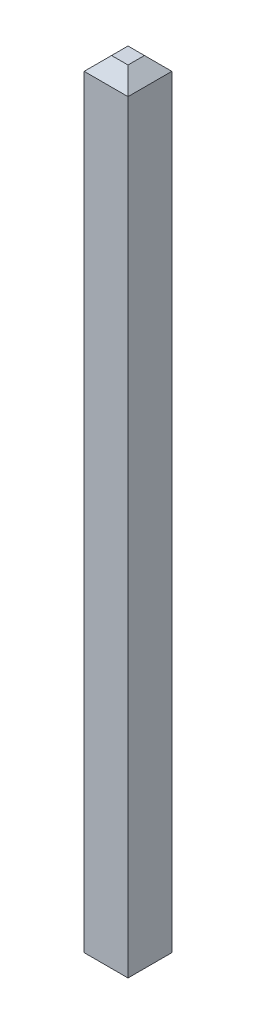
ISO-10303-21;
HEADER;
FILE_DESCRIPTION(('STEP AP214'),'2;1');
FILE_NAME('part.step','',(''),(''),'','','');
FILE_SCHEMA(('AUTOMOTIVE_DESIGN { 1 0 10303 214 1 1 1 1 }'));
ENDSEC;
DATA;
#1=APPLICATION_CONTEXT('core data for automotive mechanical design processes');
#2=APPLICATION_PROTOCOL_DEFINITION('international standard','automotive_design',2000,#1);
#3=PRODUCT_CONTEXT('',#1,'mechanical');
#4=PRODUCT('Part','Part','',(#3));
#5=PRODUCT_RELATED_PRODUCT_CATEGORY('part','',(#4));
#6=PRODUCT_DEFINITION_FORMATION('','',#4);
#7=PRODUCT_DEFINITION_CONTEXT('part definition',#1,'design');
#8=PRODUCT_DEFINITION('design','',#6,#7);
#9=PRODUCT_DEFINITION_SHAPE('','',#8);
#10=(LENGTH_UNIT() NAMED_UNIT(*) SI_UNIT(.MILLI.,.METRE.));
#11=(NAMED_UNIT(*) PLANE_ANGLE_UNIT() SI_UNIT($,.RADIAN.));
#12=(NAMED_UNIT(*) SI_UNIT($,.STERADIAN.) SOLID_ANGLE_UNIT());
#13=UNCERTAINTY_MEASURE_WITH_UNIT(LENGTH_MEASURE(1.E-05),#10,'distance_accuracy_value','');
#14=(GEOMETRIC_REPRESENTATION_CONTEXT(3) GLOBAL_UNCERTAINTY_ASSIGNED_CONTEXT((#13)) GLOBAL_UNIT_ASSIGNED_CONTEXT((#10,
#11,#12)) REPRESENTATION_CONTEXT('',''));
#15=CARTESIAN_POINT('',(0.,0.,0.));
#16=DIRECTION('',(0.,0.,1.));
#17=DIRECTION('',(1.,0.,0.));
#18=AXIS2_PLACEMENT_3D('',#15,#16,#17);
#19=CARTESIAN_POINT('',(9.21,7.07,-0.32));
#20=DIRECTION('',(-0.707106781186548,-0.707106781186548,0.));
#21=DIRECTION('',(-0.707106781186548,0.707106781186548,0.));
#22=AXIS2_PLACEMENT_3D('',#19,#20,#21);
#23=PLANE('',#22);
#24=DIRECTION('',(0.577350269189626,-0.577350269189626,0.577350269189626));
#25=VECTOR('',#24,1.);
#26=CARTESIAN_POINT('',(8.996666666667,7.283333333333,0.106666666667));
#27=LINE('',#26,#25);
#28=CARTESIAN_POINT('',(9.01,7.27,0.12));
#29=VERTEX_POINT('',#28);
#30=CARTESIAN_POINT('',(9.21,7.07,0.32));
#31=VERTEX_POINT('',#30);
#32=EDGE_CURVE('E129',#29,#31,#27,.T.);
#33=ORIENTED_EDGE('',*,*,#32,.T.);
#34=DIRECTION('',(0.,0.,1.));
#35=VECTOR('',#34,1.);
#36=CARTESIAN_POINT('',(9.21,7.07,-0.32));
#37=LINE('',#36,#35);
#38=CARTESIAN_POINT('',(9.21,7.07,-0.32));
#39=VERTEX_POINT('',#38);
#40=EDGE_CURVE('E103',#39,#31,#37,.T.);
#41=ORIENTED_EDGE('',*,*,#40,.F.);
#42=DIRECTION('',(0.577350269189626,-0.577350269189626,-0.577350269189626));
#43=VECTOR('',#42,1.);
#44=CARTESIAN_POINT('',(9.21,7.07,-0.32));
#45=LINE('',#44,#43);
#46=CARTESIAN_POINT('',(9.01,7.27,-0.12));
#47=VERTEX_POINT('',#46);
#48=EDGE_CURVE('E11',#47,#39,#45,.T.);
#49=ORIENTED_EDGE('',*,*,#48,.F.);
#50=DIRECTION('',(0.,0.,-1.));
#51=VECTOR('',#50,1.);
#52=CARTESIAN_POINT('',(9.01,7.27,-0.32));
#53=LINE('',#52,#51);
#54=EDGE_CURVE('E102',#29,#47,#53,.T.);
#55=ORIENTED_EDGE('',*,*,#54,.F.);
#56=EDGE_LOOP('',(#33,#41,#49,#55));
#57=FACE_BOUND('',#56,.T.);
#58=ADVANCED_FACE('F16',(#57),#23,.F.);
#59=CARTESIAN_POINT('',(8.89,7.07,-0.32));
#60=DIRECTION('',(0.,0.707106781186548,-0.707106781186548));
#61=DIRECTION('',(-1.,0.,0.));
#62=AXIS2_PLACEMENT_3D('',#59,#60,#61);
#63=PLANE('',#62);
#64=DIRECTION('',(0.577350269189626,0.577350269189626,0.577350269189626));
#65=VECTOR('',#64,1.);
#66=CARTESIAN_POINT('',(8.703333333333,7.203333333333,-0.186666666667));
#67=LINE('',#66,#65);
#68=CARTESIAN_POINT('',(8.57,7.07,-0.32));
#69=VERTEX_POINT('',#68);
#70=CARTESIAN_POINT('',(8.77,7.27,-0.12));
#71=VERTEX_POINT('',#70);
#72=EDGE_CURVE('E27',#69,#71,#67,.T.);
#73=ORIENTED_EDGE('',*,*,#72,.T.);
#74=DIRECTION('',(-1.,0.,0.));
#75=VECTOR('',#74,1.);
#76=CARTESIAN_POINT('',(8.57,7.27,-0.12));
#77=LINE('',#76,#75);
#78=EDGE_CURVE('E108',#47,#71,#77,.T.);
#79=ORIENTED_EDGE('',*,*,#78,.F.);
#80=ORIENTED_EDGE('',*,*,#48,.T.);
#81=DIRECTION('',(1.,0.,0.));
#82=VECTOR('',#81,1.);
#83=CARTESIAN_POINT('',(9.21,7.07,-0.32));
#84=LINE('',#83,#82);
#85=EDGE_CURVE('E136',#69,#39,#84,.T.);
#86=ORIENTED_EDGE('',*,*,#85,.F.);
#87=EDGE_LOOP('',(#73,#79,#80,#86));
#88=FACE_BOUND('',#87,.T.);
#89=ADVANCED_FACE('F109',(#88),#63,.T.);
#90=CARTESIAN_POINT('',(8.77,7.27,-0.32));
#91=DIRECTION('',(0.707106781186548,-0.707106781186548,0.));
#92=DIRECTION('',(0.,0.,-1.));
#93=AXIS2_PLACEMENT_3D('',#90,#91,#92);
#94=PLANE('',#93);
#95=DIRECTION('',(-0.577350269189626,-0.577350269189626,0.577350269189626));
#96=VECTOR('',#95,1.);
#97=CARTESIAN_POINT('',(8.703333333333,7.203333333333,0.186666666667));
#98=LINE('',#97,#96);
#99=CARTESIAN_POINT('',(8.77,7.27,0.12));
#100=VERTEX_POINT('',#99);
#101=CARTESIAN_POINT('',(8.57,7.07,0.32));
#102=VERTEX_POINT('',#101);
#103=EDGE_CURVE('E41',#100,#102,#98,.T.);
#104=ORIENTED_EDGE('',*,*,#103,.F.);
#105=DIRECTION('',(0.,0.,1.));
#106=VECTOR('',#105,1.);
#107=CARTESIAN_POINT('',(8.77,7.27,-0.32));
#108=LINE('',#107,#106);
#109=EDGE_CURVE('E20',#71,#100,#108,.T.);
#110=ORIENTED_EDGE('',*,*,#109,.F.);
#111=ORIENTED_EDGE('',*,*,#72,.F.);
#112=DIRECTION('',(0.,0.,-1.));
#113=VECTOR('',#112,1.);
#114=CARTESIAN_POINT('',(8.57,7.07,-0.32));
#115=LINE('',#114,#113);
#116=EDGE_CURVE('E164',#102,#69,#115,.T.);
#117=ORIENTED_EDGE('',*,*,#116,.F.);
#118=EDGE_LOOP('',(#104,#110,#111,#117));
#119=FACE_BOUND('',#118,.T.);
#120=ADVANCED_FACE('F217',(#119),#94,.F.);
#121=CARTESIAN_POINT('',(8.57,7.27,0.12));
#122=DIRECTION('',(0.,-0.707106781186548,-0.707106781186548));
#123=DIRECTION('',(0.,-0.707106781186548,0.707106781186548));
#124=AXIS2_PLACEMENT_3D('',#121,#122,#123);
#125=PLANE('',#124);
#126=ORIENTED_EDGE('',*,*,#32,.F.);
#127=DIRECTION('',(1.,0.,0.));
#128=VECTOR('',#127,1.);
#129=CARTESIAN_POINT('',(8.57,7.27,0.12));
#130=LINE('',#129,#128);
#131=EDGE_CURVE('E117',#100,#29,#130,.T.);
#132=ORIENTED_EDGE('',*,*,#131,.F.);
#133=ORIENTED_EDGE('',*,*,#103,.T.);
#134=DIRECTION('',(-1.,0.,0.));
#135=VECTOR('',#134,1.);
#136=CARTESIAN_POINT('',(8.89,7.07,0.32));
#137=LINE('',#136,#135);
#138=EDGE_CURVE('E124',#31,#102,#137,.T.);
#139=ORIENTED_EDGE('',*,*,#138,.F.);
#140=EDGE_LOOP('',(#126,#132,#133,#139));
#141=FACE_BOUND('',#140,.T.);
#142=ADVANCED_FACE('F269',(#141),#125,.F.);
#143=CARTESIAN_POINT('',(8.57,7.27,-0.32));
#144=DIRECTION('',(0.,-1.,0.));
#145=DIRECTION('',(0.,0.,-1.));
#146=AXIS2_PLACEMENT_3D('',#143,#144,#145);
#147=PLANE('',#146);
#148=ORIENTED_EDGE('',*,*,#54,.T.);
#149=ORIENTED_EDGE('',*,*,#78,.T.);
#150=ORIENTED_EDGE('',*,*,#109,.T.);
#151=ORIENTED_EDGE('',*,*,#131,.T.);
#152=EDGE_LOOP('',(#148,#149,#150,#151));
#153=FACE_BOUND('',#152,.T.);
#154=ADVANCED_FACE('F116',(#153),#147,.F.);
#155=CARTESIAN_POINT('',(9.21,7.27,-0.32));
#156=DIRECTION('',(-1.,0.,0.));
#157=DIRECTION('',(0.,1.,0.));
#158=AXIS2_PLACEMENT_3D('',#155,#156,#157);
#159=PLANE('',#158);
#160=DIRECTION('',(0.,-1.,0.));
#161=VECTOR('',#160,1.);
#162=CARTESIAN_POINT('',(9.21,7.27,-0.32));
#163=LINE('',#162,#161);
#164=CARTESIAN_POINT('',(9.21,-4.07,-0.32));
#165=VERTEX_POINT('',#164);
#166=EDGE_CURVE('E131',#39,#165,#163,.T.);
#167=ORIENTED_EDGE('',*,*,#166,.F.);
#168=ORIENTED_EDGE('',*,*,#40,.T.);
#169=DIRECTION('',(0.,-1.,0.));
#170=VECTOR('',#169,1.);
#171=CARTESIAN_POINT('',(9.21,7.27,0.32));
#172=LINE('',#171,#170);
#173=CARTESIAN_POINT('',(9.21,-4.07,0.32));
#174=VERTEX_POINT('',#173);
#175=EDGE_CURVE('E85',#31,#174,#172,.T.);
#176=ORIENTED_EDGE('',*,*,#175,.T.);
#177=DIRECTION('',(0.,0.,-1.));
#178=VECTOR('',#177,1.);
#179=CARTESIAN_POINT('',(9.21,-4.07,-0.32));
#180=LINE('',#179,#178);
#181=EDGE_CURVE('E172',#174,#165,#180,.T.);
#182=ORIENTED_EDGE('',*,*,#181,.T.);
#183=EDGE_LOOP('',(#167,#168,#176,#182));
#184=FACE_BOUND('',#183,.T.);
#185=ADVANCED_FACE('F240',(#184),#159,.F.);
#186=CARTESIAN_POINT('',(8.89,1.5,0.32));
#187=DIRECTION('',(0.,0.,-1.));
#188=DIRECTION('',(0.,-1.,0.));
#189=AXIS2_PLACEMENT_3D('',#186,#187,#188);
#190=PLANE('',#189);
#191=ORIENTED_EDGE('',*,*,#175,.F.);
#192=ORIENTED_EDGE('',*,*,#138,.T.);
#193=DIRECTION('',(0.,1.,0.));
#194=VECTOR('',#193,1.);
#195=CARTESIAN_POINT('',(8.57,-4.27,0.32));
#196=LINE('',#195,#194);
#197=CARTESIAN_POINT('',(8.57,-4.07,0.32));
#198=VERTEX_POINT('',#197);
#199=EDGE_CURVE('E135',#198,#102,#196,.T.);
#200=ORIENTED_EDGE('',*,*,#199,.F.);
#201=DIRECTION('',(1.,0.,0.));
#202=VECTOR('',#201,1.);
#203=CARTESIAN_POINT('',(8.89,-4.07,0.32));
#204=LINE('',#203,#202);
#205=EDGE_CURVE('E152',#198,#174,#204,.T.);
#206=ORIENTED_EDGE('',*,*,#205,.T.);
#207=EDGE_LOOP('',(#191,#192,#200,#206));
#208=FACE_BOUND('',#207,.T.);
#209=ADVANCED_FACE('F18',(#208),#190,.F.);
#210=CARTESIAN_POINT('',(9.01,-4.27,-0.32));
#211=DIRECTION('',(-0.707106781186548,0.707106781186548,0.));
#212=DIRECTION('',(0.,0.,1.));
#213=AXIS2_PLACEMENT_3D('',#210,#211,#212);
#214=PLANE('',#213);
#215=DIRECTION('',(-0.577350269189626,-0.577350269189626,0.577350269189626));
#216=VECTOR('',#215,1.);
#217=CARTESIAN_POINT('',(9.076666666667,-4.203333333333,-0.186666666667));
#218=LINE('',#217,#216);
#219=CARTESIAN_POINT('',(9.01,-4.27,-0.12));
#220=VERTEX_POINT('',#219);
#221=EDGE_CURVE('E184',#165,#220,#218,.T.);
#222=ORIENTED_EDGE('',*,*,#221,.F.);
#223=ORIENTED_EDGE('',*,*,#181,.F.);
#224=DIRECTION('',(-0.577350269189626,-0.577350269189626,-0.577350269189626));
#225=VECTOR('',#224,1.);
#226=CARTESIAN_POINT('',(8.863333333333,-4.416666666667,-0.02666666666667));
#227=LINE('',#226,#225);
#228=CARTESIAN_POINT('',(9.01,-4.27,0.12));
#229=VERTEX_POINT('',#228);
#230=EDGE_CURVE('E205',#174,#229,#227,.T.);
#231=ORIENTED_EDGE('',*,*,#230,.T.);
#232=DIRECTION('',(0.,0.,1.));
#233=VECTOR('',#232,1.);
#234=CARTESIAN_POINT('',(9.01,-4.27,-0.32));
#235=LINE('',#234,#233);
#236=EDGE_CURVE('E194',#220,#229,#235,.T.);
#237=ORIENTED_EDGE('',*,*,#236,.F.);
#238=EDGE_LOOP('',(#222,#223,#231,#237));
#239=FACE_BOUND('',#238,.T.);
#240=ADVANCED_FACE('F245',(#239),#214,.F.);
#241=CARTESIAN_POINT('',(9.21,-4.27,0.12));
#242=DIRECTION('',(0.,0.707106781186548,-0.707106781186548));
#243=DIRECTION('',(-1.,0.,0.));
#244=AXIS2_PLACEMENT_3D('',#241,#242,#243);
#245=PLANE('',#244);
#246=ORIENTED_EDGE('',*,*,#230,.F.);
#247=ORIENTED_EDGE('',*,*,#205,.F.);
#248=DIRECTION('',(-0.577350269189626,0.577350269189626,0.577350269189626));
#249=VECTOR('',#248,1.);
#250=CARTESIAN_POINT('',(8.783333333333,-4.283333333333,0.106666666667));
#251=LINE('',#250,#249);
#252=CARTESIAN_POINT('',(8.77,-4.27,0.12));
#253=VERTEX_POINT('',#252);
#254=EDGE_CURVE('E163',#253,#198,#251,.T.);
#255=ORIENTED_EDGE('',*,*,#254,.F.);
#256=DIRECTION('',(-1.,0.,0.));
#257=VECTOR('',#256,1.);
#258=CARTESIAN_POINT('',(9.21,-4.27,0.12));
#259=LINE('',#258,#257);
#260=EDGE_CURVE('E168',#229,#253,#259,.T.);
#261=ORIENTED_EDGE('',*,*,#260,.F.);
#262=EDGE_LOOP('',(#246,#247,#255,#261));
#263=FACE_BOUND('',#262,.T.);
#264=ADVANCED_FACE('F226',(#263),#245,.F.);
#265=CARTESIAN_POINT('',(8.57,-4.07,-0.32));
#266=DIRECTION('',(0.707106781186548,0.707106781186548,0.));
#267=DIRECTION('',(0.,0.,-1.));
#268=AXIS2_PLACEMENT_3D('',#265,#266,#267);
#269=PLANE('',#268);
#270=DIRECTION('',(0.577350269189626,-0.577350269189626,0.577350269189626));
#271=VECTOR('',#270,1.);
#272=CARTESIAN_POINT('',(8.676666666667,-4.176666666667,-0.213333333333));
#273=LINE('',#272,#271);
#274=CARTESIAN_POINT('',(8.57,-4.07,-0.32));
#275=VERTEX_POINT('',#274);
#276=CARTESIAN_POINT('',(8.77,-4.27,-0.12));
#277=VERTEX_POINT('',#276);
#278=EDGE_CURVE('E157',#275,#277,#273,.T.);
#279=ORIENTED_EDGE('',*,*,#278,.T.);
#280=DIRECTION('',(0.,0.,-1.));
#281=VECTOR('',#280,1.);
#282=CARTESIAN_POINT('',(8.77,-4.27,-0.32));
#283=LINE('',#282,#281);
#284=EDGE_CURVE('E158',#253,#277,#283,.T.);
#285=ORIENTED_EDGE('',*,*,#284,.F.);
#286=ORIENTED_EDGE('',*,*,#254,.T.);
#287=DIRECTION('',(0.,0.,1.));
#288=VECTOR('',#287,1.);
#289=CARTESIAN_POINT('',(8.57,-4.07,-0.32));
#290=LINE('',#289,#288);
#291=EDGE_CURVE('E159',#275,#198,#290,.T.);
#292=ORIENTED_EDGE('',*,*,#291,.F.);
#293=EDGE_LOOP('',(#279,#285,#286,#292));
#294=FACE_BOUND('',#293,.T.);
#295=ADVANCED_FACE('F221',(#294),#269,.F.);
#296=CARTESIAN_POINT('',(8.57,-4.27,-0.32));
#297=DIRECTION('',(1.,0.,0.));
#298=DIRECTION('',(0.,0.,1.));
#299=AXIS2_PLACEMENT_3D('',#296,#297,#298);
#300=PLANE('',#299);
#301=ORIENTED_EDGE('',*,*,#199,.T.);
#302=ORIENTED_EDGE('',*,*,#116,.T.);
#303=DIRECTION('',(0.,1.,0.));
#304=VECTOR('',#303,1.);
#305=CARTESIAN_POINT('',(8.57,-4.27,-0.32));
#306=LINE('',#305,#304);
#307=EDGE_CURVE('E141',#275,#69,#306,.T.);
#308=ORIENTED_EDGE('',*,*,#307,.F.);
#309=ORIENTED_EDGE('',*,*,#291,.T.);
#310=EDGE_LOOP('',(#301,#302,#308,#309));
#311=FACE_BOUND('',#310,.T.);
#312=ADVANCED_FACE('F220',(#311),#300,.F.);
#313=CARTESIAN_POINT('',(8.89,1.5,-0.32));
#314=DIRECTION('',(0.,0.,-1.));
#315=DIRECTION('',(0.,-1.,0.));
#316=AXIS2_PLACEMENT_3D('',#313,#314,#315);
#317=PLANE('',#316);
#318=ORIENTED_EDGE('',*,*,#307,.T.);
#319=ORIENTED_EDGE('',*,*,#85,.T.);
#320=ORIENTED_EDGE('',*,*,#166,.T.);
#321=DIRECTION('',(-1.,0.,0.));
#322=VECTOR('',#321,1.);
#323=CARTESIAN_POINT('',(8.57,-4.07,-0.32));
#324=LINE('',#323,#322);
#325=EDGE_CURVE('E176',#165,#275,#324,.T.);
#326=ORIENTED_EDGE('',*,*,#325,.T.);
#327=EDGE_LOOP('',(#318,#319,#320,#326));
#328=FACE_BOUND('',#327,.T.);
#329=ADVANCED_FACE('F243',(#328),#317,.T.);
#330=CARTESIAN_POINT('',(8.89,-4.07,-0.32));
#331=DIRECTION('',(0.,-0.707106781186548,-0.707106781186548));
#332=DIRECTION('',(0.,-0.707106781186548,0.707106781186548));
#333=AXIS2_PLACEMENT_3D('',#330,#331,#332);
#334=PLANE('',#333);
#335=ORIENTED_EDGE('',*,*,#278,.F.);
#336=ORIENTED_EDGE('',*,*,#325,.F.);
#337=ORIENTED_EDGE('',*,*,#221,.T.);
#338=DIRECTION('',(1.,0.,0.));
#339=VECTOR('',#338,1.);
#340=CARTESIAN_POINT('',(9.21,-4.27,-0.12));
#341=LINE('',#340,#339);
#342=EDGE_CURVE('E154',#277,#220,#341,.T.);
#343=ORIENTED_EDGE('',*,*,#342,.F.);
#344=EDGE_LOOP('',(#335,#336,#337,#343));
#345=FACE_BOUND('',#344,.T.);
#346=ADVANCED_FACE('F247',(#345),#334,.T.);
#347=CARTESIAN_POINT('',(9.21,-4.27,-0.32));
#348=DIRECTION('',(0.,1.,0.));
#349=DIRECTION('',(0.,0.,-1.));
#350=AXIS2_PLACEMENT_3D('',#347,#348,#349);
#351=PLANE('',#350);
#352=ORIENTED_EDGE('',*,*,#236,.T.);
#353=ORIENTED_EDGE('',*,*,#260,.T.);
#354=ORIENTED_EDGE('',*,*,#284,.T.);
#355=ORIENTED_EDGE('',*,*,#342,.T.);
#356=EDGE_LOOP('',(#352,#353,#354,#355));
#357=FACE_BOUND('',#356,.T.);
#358=ADVANCED_FACE('F249',(#357),#351,.F.);
#359=CLOSED_SHELL('',(#58,#89,#120,#142,#154,#185,#209,#240,#264,#295,#312,#329,#346,#358));
#360=MANIFOLD_SOLID_BREP('B1',#359);
#361=ADVANCED_BREP_SHAPE_REPRESENTATION('',(#18,#360),#14);
#362=SHAPE_DEFINITION_REPRESENTATION(#9,#361);
ENDSEC;
END-ISO-10303-21;
